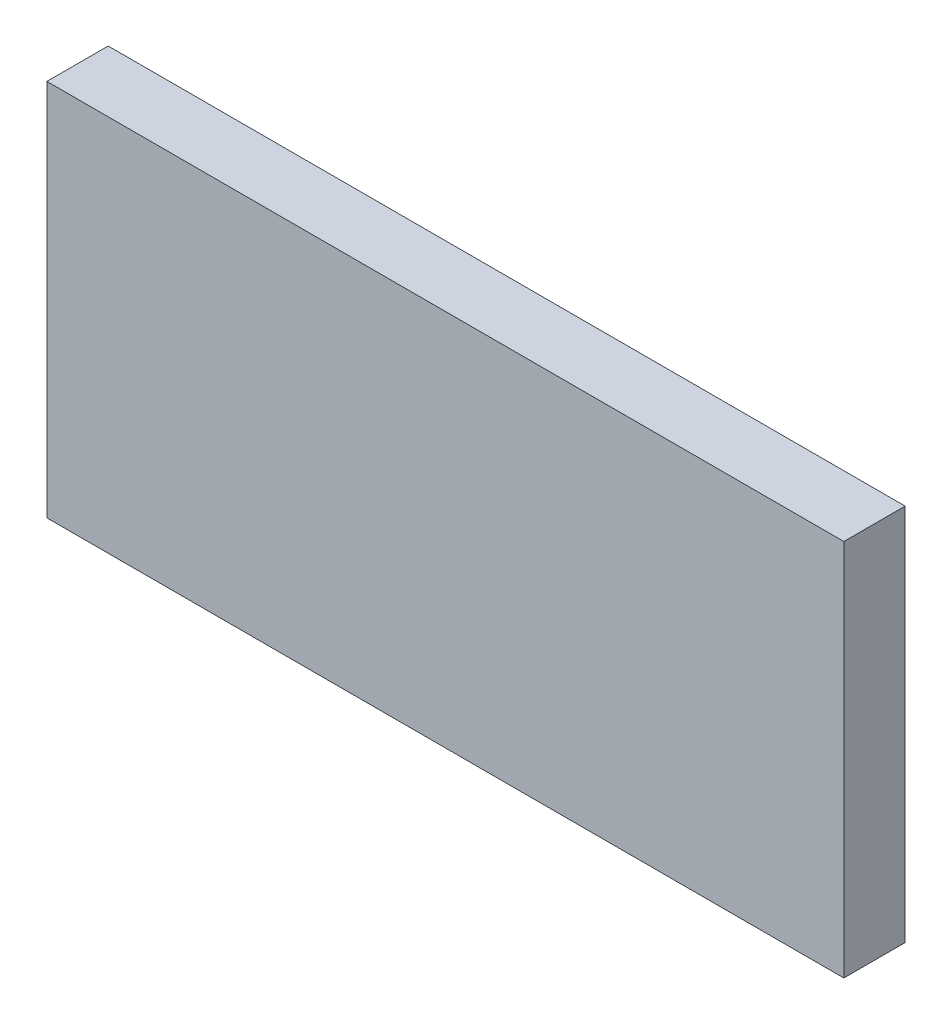
ISO-10303-21;
HEADER;
FILE_DESCRIPTION(('STEP AP214'),'2;1');
FILE_NAME('part.step','',(''),(''),'','','');
FILE_SCHEMA(('AUTOMOTIVE_DESIGN { 1 0 10303 214 1 1 1 1 }'));
ENDSEC;
DATA;
#1=APPLICATION_CONTEXT('core data for automotive mechanical design processes');
#2=APPLICATION_PROTOCOL_DEFINITION('international standard','automotive_design',2000,#1);
#3=PRODUCT_CONTEXT('',#1,'mechanical');
#4=PRODUCT('Part','Part','',(#3));
#5=PRODUCT_RELATED_PRODUCT_CATEGORY('part','',(#4));
#6=PRODUCT_DEFINITION_FORMATION('','',#4);
#7=PRODUCT_DEFINITION_CONTEXT('part definition',#1,'design');
#8=PRODUCT_DEFINITION('design','',#6,#7);
#9=PRODUCT_DEFINITION_SHAPE('','',#8);
#10=(LENGTH_UNIT() NAMED_UNIT(*) SI_UNIT(.MILLI.,.METRE.));
#11=(NAMED_UNIT(*) PLANE_ANGLE_UNIT() SI_UNIT($,.RADIAN.));
#12=(NAMED_UNIT(*) SI_UNIT($,.STERADIAN.) SOLID_ANGLE_UNIT());
#13=UNCERTAINTY_MEASURE_WITH_UNIT(LENGTH_MEASURE(1.E-05),#10,'distance_accuracy_value','');
#14=(GEOMETRIC_REPRESENTATION_CONTEXT(3) GLOBAL_UNCERTAINTY_ASSIGNED_CONTEXT((#13)) GLOBAL_UNIT_ASSIGNED_CONTEXT((#10,
#11,#12)) REPRESENTATION_CONTEXT('',''));
#15=CARTESIAN_POINT('',(0.,0.,0.));
#16=DIRECTION('',(0.,0.,1.));
#17=DIRECTION('',(1.,0.,0.));
#18=AXIS2_PLACEMENT_3D('',#15,#16,#17);
#19=CARTESIAN_POINT('',(0.,0.,3.));
#20=DIRECTION('',(1.,0.,0.));
#21=DIRECTION('',(0.,0.,-1.));
#22=AXIS2_PLACEMENT_3D('',#19,#20,#21);
#23=PLANE('',#22);
#24=DIRECTION('',(0.,-1.,0.));
#25=VECTOR('',#24,1.);
#26=CARTESIAN_POINT('',(0.,0.,0.));
#27=LINE('',#26,#25);
#28=CARTESIAN_POINT('',(0.,18.5,0.));
#29=VERTEX_POINT('',#28);
#30=CARTESIAN_POINT('',(0.,0.,0.));
#31=VERTEX_POINT('',#30);
#32=EDGE_CURVE('E95',#29,#31,#27,.T.);
#33=ORIENTED_EDGE('',*,*,#32,.T.);
#34=DIRECTION('',(0.,0.,-1.));
#35=VECTOR('',#34,1.);
#36=CARTESIAN_POINT('',(0.,0.,3.));
#37=LINE('',#36,#35);
#38=CARTESIAN_POINT('',(0.,0.,3.));
#39=VERTEX_POINT('',#38);
#40=EDGE_CURVE('E11',#39,#31,#37,.T.);
#41=ORIENTED_EDGE('',*,*,#40,.F.);
#42=DIRECTION('',(0.,-1.,0.));
#43=VECTOR('',#42,1.);
#44=CARTESIAN_POINT('',(0.,0.,3.));
#45=LINE('',#44,#43);
#46=CARTESIAN_POINT('',(0.,18.5,3.));
#47=VERTEX_POINT('',#46);
#48=EDGE_CURVE('E83',#47,#39,#45,.T.);
#49=ORIENTED_EDGE('',*,*,#48,.F.);
#50=DIRECTION('',(0.,0.,-1.));
#51=VECTOR('',#50,1.);
#52=CARTESIAN_POINT('',(0.,18.5,3.));
#53=LINE('',#52,#51);
#54=EDGE_CURVE('E91',#47,#29,#53,.T.);
#55=ORIENTED_EDGE('',*,*,#54,.T.);
#56=EDGE_LOOP('',(#33,#41,#49,#55));
#57=FACE_BOUND('',#56,.T.);
#58=ADVANCED_FACE('F32',(#57),#23,.F.);
#59=CARTESIAN_POINT('',(0.,0.,3.));
#60=DIRECTION('',(0.,1.,0.));
#61=DIRECTION('',(0.,0.,1.));
#62=AXIS2_PLACEMENT_3D('',#59,#60,#61);
#63=PLANE('',#62);
#64=DIRECTION('',(1.,0.,0.));
#65=VECTOR('',#64,1.);
#66=CARTESIAN_POINT('',(0.,0.,0.));
#67=LINE('',#66,#65);
#68=CARTESIAN_POINT('',(39.,0.,0.));
#69=VERTEX_POINT('',#68);
#70=EDGE_CURVE('E87',#31,#69,#67,.T.);
#71=ORIENTED_EDGE('',*,*,#70,.T.);
#72=DIRECTION('',(0.,0.,-1.));
#73=VECTOR('',#72,1.);
#74=CARTESIAN_POINT('',(39.,0.,3.));
#75=LINE('',#74,#73);
#76=CARTESIAN_POINT('',(39.,0.,3.));
#77=VERTEX_POINT('',#76);
#78=EDGE_CURVE('E40',#77,#69,#75,.T.);
#79=ORIENTED_EDGE('',*,*,#78,.F.);
#80=DIRECTION('',(1.,0.,0.));
#81=VECTOR('',#80,1.);
#82=CARTESIAN_POINT('',(0.,0.,3.));
#83=LINE('',#82,#81);
#84=EDGE_CURVE('E78',#39,#77,#83,.T.);
#85=ORIENTED_EDGE('',*,*,#84,.F.);
#86=ORIENTED_EDGE('',*,*,#40,.T.);
#87=EDGE_LOOP('',(#71,#79,#85,#86));
#88=FACE_BOUND('',#87,.T.);
#89=ADVANCED_FACE('F86',(#88),#63,.F.);
#90=CARTESIAN_POINT('',(39.,0.,3.));
#91=DIRECTION('',(-1.,0.,0.));
#92=DIRECTION('',(0.,0.,1.));
#93=AXIS2_PLACEMENT_3D('',#90,#91,#92);
#94=PLANE('',#93);
#95=DIRECTION('',(0.,1.,0.));
#96=VECTOR('',#95,1.);
#97=CARTESIAN_POINT('',(39.,0.,0.));
#98=LINE('',#97,#96);
#99=CARTESIAN_POINT('',(39.,18.5,0.));
#100=VERTEX_POINT('',#99);
#101=EDGE_CURVE('E65',#69,#100,#98,.T.);
#102=ORIENTED_EDGE('',*,*,#101,.T.);
#103=DIRECTION('',(0.,0.,-1.));
#104=VECTOR('',#103,1.);
#105=CARTESIAN_POINT('',(39.,18.5,3.));
#106=LINE('',#105,#104);
#107=CARTESIAN_POINT('',(39.,18.5,3.));
#108=VERTEX_POINT('',#107);
#109=EDGE_CURVE('E88',#108,#100,#106,.T.);
#110=ORIENTED_EDGE('',*,*,#109,.F.);
#111=DIRECTION('',(0.,1.,0.));
#112=VECTOR('',#111,1.);
#113=CARTESIAN_POINT('',(39.,0.,3.));
#114=LINE('',#113,#112);
#115=EDGE_CURVE('E81',#77,#108,#114,.T.);
#116=ORIENTED_EDGE('',*,*,#115,.F.);
#117=ORIENTED_EDGE('',*,*,#78,.T.);
#118=EDGE_LOOP('',(#102,#110,#116,#117));
#119=FACE_BOUND('',#118,.T.);
#120=ADVANCED_FACE('F89',(#119),#94,.F.);
#121=CARTESIAN_POINT('',(0.,18.5,3.));
#122=DIRECTION('',(0.,-1.,0.));
#123=DIRECTION('',(0.,0.,-1.));
#124=AXIS2_PLACEMENT_3D('',#121,#122,#123);
#125=PLANE('',#124);
#126=DIRECTION('',(-1.,0.,0.));
#127=VECTOR('',#126,1.);
#128=CARTESIAN_POINT('',(0.,18.5,0.));
#129=LINE('',#128,#127);
#130=EDGE_CURVE('E71',#100,#29,#129,.T.);
#131=ORIENTED_EDGE('',*,*,#130,.T.);
#132=ORIENTED_EDGE('',*,*,#54,.F.);
#133=DIRECTION('',(-1.,0.,0.));
#134=VECTOR('',#133,1.);
#135=CARTESIAN_POINT('',(0.,18.5,3.));
#136=LINE('',#135,#134);
#137=EDGE_CURVE('E48',#108,#47,#136,.T.);
#138=ORIENTED_EDGE('',*,*,#137,.F.);
#139=ORIENTED_EDGE('',*,*,#109,.T.);
#140=EDGE_LOOP('',(#131,#132,#138,#139));
#141=FACE_BOUND('',#140,.T.);
#142=ADVANCED_FACE('F102',(#141),#125,.F.);
#143=CARTESIAN_POINT('',(0.,0.,3.));
#144=DIRECTION('',(0.,0.,-1.));
#145=DIRECTION('',(-1.,0.,0.));
#146=AXIS2_PLACEMENT_3D('',#143,#144,#145);
#147=PLANE('',#146);
#148=ORIENTED_EDGE('',*,*,#48,.T.);
#149=ORIENTED_EDGE('',*,*,#84,.T.);
#150=ORIENTED_EDGE('',*,*,#115,.T.);
#151=ORIENTED_EDGE('',*,*,#137,.T.);
#152=EDGE_LOOP('',(#148,#149,#150,#151));
#153=FACE_BOUND('',#152,.T.);
#154=ADVANCED_FACE('F79',(#153),#147,.F.);
#155=CARTESIAN_POINT('',(0.,0.,0.));
#156=DIRECTION('',(0.,0.,-1.));
#157=DIRECTION('',(-1.,0.,0.));
#158=AXIS2_PLACEMENT_3D('',#155,#156,#157);
#159=PLANE('',#158);
#160=ORIENTED_EDGE('',*,*,#32,.F.);
#161=ORIENTED_EDGE('',*,*,#130,.F.);
#162=ORIENTED_EDGE('',*,*,#101,.F.);
#163=ORIENTED_EDGE('',*,*,#70,.F.);
#164=EDGE_LOOP('',(#160,#161,#162,#163));
#165=FACE_BOUND('',#164,.T.);
#166=ADVANCED_FACE('F105',(#165),#159,.T.);
#167=CLOSED_SHELL('',(#58,#89,#120,#142,#154,#166));
#168=MANIFOLD_SOLID_BREP('B2',#167);
#169=ADVANCED_BREP_SHAPE_REPRESENTATION('',(#18,#168),#14);
#170=SHAPE_DEFINITION_REPRESENTATION(#9,#169);
ENDSEC;
END-ISO-10303-21;
